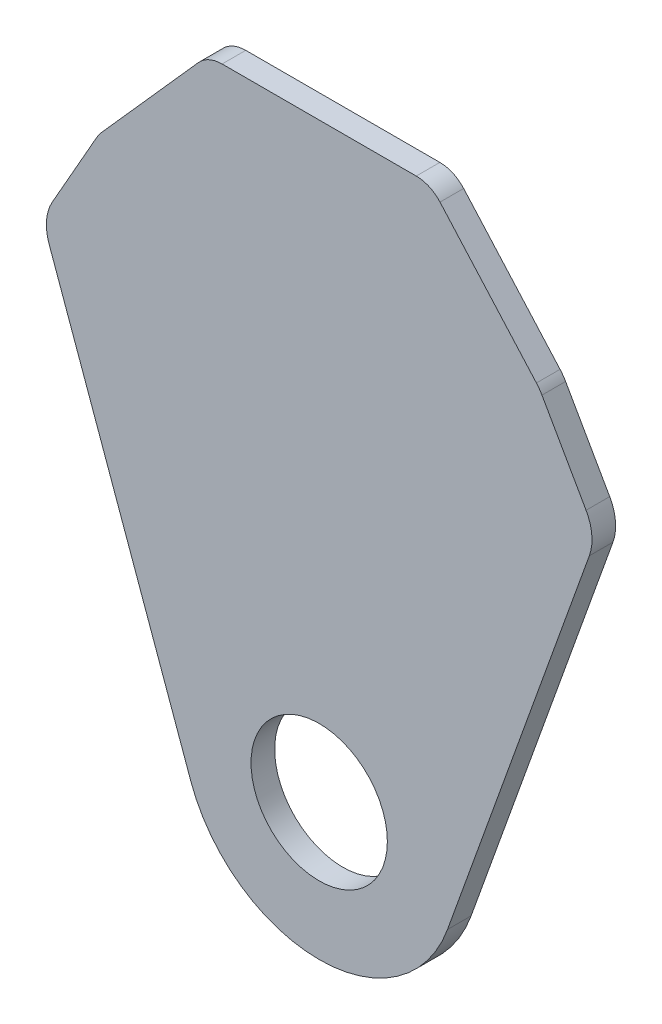
ISO-10303-21;
HEADER;
FILE_DESCRIPTION(('STEP AP214'),'2;1');
FILE_NAME('part.step','',(''),(''),'','','');
FILE_SCHEMA(('AUTOMOTIVE_DESIGN { 1 0 10303 214 1 1 1 1 }'));
ENDSEC;
DATA;
#1=APPLICATION_CONTEXT('core data for automotive mechanical design processes');
#2=APPLICATION_PROTOCOL_DEFINITION('international standard','automotive_design',2000,#1);
#3=PRODUCT_CONTEXT('',#1,'mechanical');
#4=PRODUCT('Part','Part','',(#3));
#5=PRODUCT_RELATED_PRODUCT_CATEGORY('part','',(#4));
#6=PRODUCT_DEFINITION_FORMATION('','',#4);
#7=PRODUCT_DEFINITION_CONTEXT('part definition',#1,'design');
#8=PRODUCT_DEFINITION('design','',#6,#7);
#9=PRODUCT_DEFINITION_SHAPE('','',#8);
#10=(LENGTH_UNIT() NAMED_UNIT(*) SI_UNIT(.MILLI.,.METRE.));
#11=(NAMED_UNIT(*) PLANE_ANGLE_UNIT() SI_UNIT($,.RADIAN.));
#12=(NAMED_UNIT(*) SI_UNIT($,.STERADIAN.) SOLID_ANGLE_UNIT());
#13=UNCERTAINTY_MEASURE_WITH_UNIT(LENGTH_MEASURE(1.E-05),#10,'distance_accuracy_value','');
#14=(GEOMETRIC_REPRESENTATION_CONTEXT(3) GLOBAL_UNCERTAINTY_ASSIGNED_CONTEXT((#13)) GLOBAL_UNIT_ASSIGNED_CONTEXT((#10,
#11,#12)) REPRESENTATION_CONTEXT('',''));
#15=CARTESIAN_POINT('',(0.,0.,0.));
#16=DIRECTION('',(0.,0.,1.));
#17=DIRECTION('',(1.,0.,0.));
#18=AXIS2_PLACEMENT_3D('',#15,#16,#17);
#19=CARTESIAN_POINT('',(0.,0.,6.604));
#20=DIRECTION('',(0.,0.,1.));
#21=DIRECTION('',(1.,0.,0.));
#22=AXIS2_PLACEMENT_3D('',#19,#20,#21);
#23=PLANE('',#22);
#24=DIRECTION('',(-1.,0.,0.));
#25=VECTOR('',#24,1.);
#26=CARTESIAN_POINT('',(-31.115,165.1,6.604));
#27=LINE('',#26,#25);
#28=CARTESIAN_POINT('',(27.1228026882818,165.1,6.604));
#29=VERTEX_POINT('',#28);
#30=CARTESIAN_POINT('',(-27.1228026882818,165.1,6.604));
#31=VERTEX_POINT('',#30);
#32=EDGE_CURVE('E174',#29,#31,#27,.T.);
#33=ORIENTED_EDGE('',*,*,#32,.T.);
#34=CARTESIAN_POINT('',(-27.1228026882818,156.21,6.604));
#35=DIRECTION('',(0.,0.,1.));
#36=DIRECTION('',(1.,0.,0.));
#37=AXIS2_PLACEMENT_3D('',#34,#35,#36);
#38=CIRCLE('',#37,8.89);
#39=CARTESIAN_POINT('',(-33.7672715313796,162.116194527198,6.604));
#40=VERTEX_POINT('',#39);
#41=EDGE_CURVE('E42',#31,#40,#38,.T.);
#42=ORIENTED_EDGE('',*,*,#41,.T.);
#43=DIRECTION('',(-0.66436383882992,-0.74740931868366,0.));
#44=VECTOR('',#43,1.);
#45=CARTESIAN_POINT('',(-61.595,130.81,6.604));
#46=LINE('',#45,#44);
#47=CARTESIAN_POINT('',(-60.7060258218473,131.810095950422,6.604));
#48=VERTEX_POINT('',#47);
#49=EDGE_CURVE('E195',#40,#48,#46,.T.);
#50=ORIENTED_EDGE('',*,*,#49,.T.);
#51=CARTESIAN_POINT('',(-51.2139274745648,123.372675197282,6.604));
#52=DIRECTION('',(0.,0.,1.));
#53=DIRECTION('',(1.,0.,0.));
#54=AXIS2_PLACEMENT_3D('',#51,#52,#53);
#55=CIRCLE('',#54,12.7);
#56=CARTESIAN_POINT('',(-62.2560257534529,129.646594673923,6.604));
#57=VERTEX_POINT('',#56);
#58=EDGE_CURVE('E216',#48,#57,#55,.T.);
#59=ORIENTED_EDGE('',*,*,#58,.T.);
#60=DIRECTION('',(-0.494009407609527,-0.869456557392768,0.));
#61=VECTOR('',#60,1.);
#62=CARTESIAN_POINT('',(-77.47,102.87,6.604));
#63=LINE('',#62,#61);
#64=CARTESIAN_POINT('',(-74.5857521885567,107.94627614814,6.604));
#65=VERTEX_POINT('',#64);
#66=EDGE_CURVE('E149',#57,#65,#63,.T.);
#67=ORIENTED_EDGE('',*,*,#66,.T.);
#68=CARTESIAN_POINT('',(-63.5436539096686,101.672356671499,6.604));
#69=DIRECTION('',(0.,0.,1.));
#70=DIRECTION('',(1.,0.,0.));
#71=AXIS2_PLACEMENT_3D('',#68,#69,#70);
#72=CIRCLE('',#71,12.7);
#73=CARTESIAN_POINT('',(-75.4947945005195,97.3758186956732,6.604));
#74=VERTEX_POINT('',#73);
#75=EDGE_CURVE('E145',#65,#74,#72,.T.);
#76=ORIENTED_EDGE('',*,*,#75,.T.);
#77=DIRECTION('',(0.338310076836694,-0.941034692192987,0.));
#78=VECTOR('',#77,1.);
#79=CARTESIAN_POINT('',(-77.47,102.87,6.604));
#80=LINE('',#79,#78);
#81=CARTESIAN_POINT('',(-35.8534217725528,-12.889613927478,6.604));
#82=VERTEX_POINT('',#81);
#83=EDGE_CURVE('E136',#74,#82,#80,.T.);
#84=ORIENTED_EDGE('',*,*,#83,.T.);
#85=CARTESIAN_POINT('',(0.,0.,6.604));
#86=DIRECTION('',(0.,0.,1.));
#87=DIRECTION('',(1.,0.,0.));
#88=AXIS2_PLACEMENT_3D('',#85,#86,#87);
#89=CIRCLE('',#88,38.1);
#90=CARTESIAN_POINT('',(35.8534217725528,-12.889613927478,6.604));
#91=VERTEX_POINT('',#90);
#92=EDGE_CURVE('E141',#82,#91,#89,.T.);
#93=ORIENTED_EDGE('',*,*,#92,.T.);
#94=DIRECTION('',(0.338310076836694,0.941034692192987,0.));
#95=VECTOR('',#94,1.);
#96=CARTESIAN_POINT('',(77.47,102.87,6.604));
#97=LINE('',#96,#95);
#98=CARTESIAN_POINT('',(75.4947945005195,97.3758186956732,6.604));
#99=VERTEX_POINT('',#98);
#100=EDGE_CURVE('E164',#91,#99,#97,.T.);
#101=ORIENTED_EDGE('',*,*,#100,.T.);
#102=CARTESIAN_POINT('',(63.5436539096686,101.672356671499,6.604));
#103=DIRECTION('',(0.,0.,1.));
#104=DIRECTION('',(1.,0.,0.));
#105=AXIS2_PLACEMENT_3D('',#102,#103,#104);
#106=CIRCLE('',#105,12.7);
#107=CARTESIAN_POINT('',(74.5857521885567,107.94627614814,6.604));
#108=VERTEX_POINT('',#107);
#109=EDGE_CURVE('E212',#99,#108,#106,.T.);
#110=ORIENTED_EDGE('',*,*,#109,.T.);
#111=DIRECTION('',(-0.494009407609527,0.869456557392768,0.));
#112=VECTOR('',#111,1.);
#113=CARTESIAN_POINT('',(77.47,102.87,6.604));
#114=LINE('',#113,#112);
#115=CARTESIAN_POINT('',(62.2560257534529,129.646594673923,6.604));
#116=VERTEX_POINT('',#115);
#117=EDGE_CURVE('E166',#108,#116,#114,.T.);
#118=ORIENTED_EDGE('',*,*,#117,.T.);
#119=CARTESIAN_POINT('',(51.2139274745648,123.372675197282,6.604));
#120=DIRECTION('',(0.,0.,1.));
#121=DIRECTION('',(1.,0.,0.));
#122=AXIS2_PLACEMENT_3D('',#119,#120,#121);
#123=CIRCLE('',#122,12.7);
#124=CARTESIAN_POINT('',(60.7060258218473,131.810095950422,6.604));
#125=VERTEX_POINT('',#124);
#126=EDGE_CURVE('E214',#116,#125,#123,.T.);
#127=ORIENTED_EDGE('',*,*,#126,.T.);
#128=DIRECTION('',(-0.66436383882992,0.74740931868366,0.));
#129=VECTOR('',#128,1.);
#130=CARTESIAN_POINT('',(31.115,165.1,6.604));
#131=LINE('',#130,#129);
#132=CARTESIAN_POINT('',(33.7672715313796,162.116194527198,6.604));
#133=VERTEX_POINT('',#132);
#134=EDGE_CURVE('E172',#125,#133,#131,.T.);
#135=ORIENTED_EDGE('',*,*,#134,.T.);
#136=CARTESIAN_POINT('',(27.1228026882818,156.21,6.604));
#137=DIRECTION('',(0.,0.,1.));
#138=DIRECTION('',(1.,0.,0.));
#139=AXIS2_PLACEMENT_3D('',#136,#137,#138);
#140=CIRCLE('',#139,8.89);
#141=EDGE_CURVE('E243',#133,#29,#140,.T.);
#142=ORIENTED_EDGE('',*,*,#141,.T.);
#143=EDGE_LOOP('',(#33,#42,#50,#59,#67,#76,#84,#93,#101,#110,#118,#127,#135,#142));
#144=FACE_BOUND('',#143,.T.);
#145=CARTESIAN_POINT('',(0.,0.,6.604));
#146=DIRECTION('',(0.,0.,1.));
#147=DIRECTION('',(1.,0.,0.));
#148=AXIS2_PLACEMENT_3D('',#145,#146,#147);
#149=CIRCLE('',#148,19.05);
#150=CARTESIAN_POINT('',(19.05,0.,6.604));
#151=VERTEX_POINT('',#150);
#152=EDGE_CURVE('E179',#151,#151,#149,.T.);
#153=ORIENTED_EDGE('',*,*,#152,.F.);
#154=EDGE_LOOP('',(#153));
#155=FACE_BOUND('',#154,.T.);
#156=ADVANCED_FACE('F34',(#144,#155),#23,.T.);
#157=CARTESIAN_POINT('',(0.,0.,0.));
#158=DIRECTION('',(0.,0.,1.));
#159=DIRECTION('',(1.,0.,0.));
#160=AXIS2_PLACEMENT_3D('',#157,#158,#159);
#161=PLANE('',#160);
#162=DIRECTION('',(-0.66436383882992,-0.74740931868366,0.));
#163=VECTOR('',#162,1.);
#164=CARTESIAN_POINT('',(-61.595,130.81,0.));
#165=LINE('',#164,#163);
#166=CARTESIAN_POINT('',(-33.7672715313796,162.116194527198,0.));
#167=VERTEX_POINT('',#166);
#168=CARTESIAN_POINT('',(-60.7060258218473,131.810095950422,0.));
#169=VERTEX_POINT('',#168);
#170=EDGE_CURVE('E176',#167,#169,#165,.T.);
#171=ORIENTED_EDGE('',*,*,#170,.F.);
#172=CARTESIAN_POINT('',(-27.1228026882818,156.21,0.));
#173=DIRECTION('',(0.,0.,1.));
#174=DIRECTION('',(1.,0.,0.));
#175=AXIS2_PLACEMENT_3D('',#172,#173,#174);
#176=CIRCLE('',#175,8.89);
#177=CARTESIAN_POINT('',(-27.1228026882818,165.1,0.));
#178=VERTEX_POINT('',#177);
#179=EDGE_CURVE('E237',#167,#178,#176,.F.);
#180=ORIENTED_EDGE('',*,*,#179,.T.);
#181=DIRECTION('',(-1.,0.,0.));
#182=VECTOR('',#181,1.);
#183=CARTESIAN_POINT('',(-31.115,165.1,0.));
#184=LINE('',#183,#182);
#185=CARTESIAN_POINT('',(27.1228026882818,165.1,0.));
#186=VERTEX_POINT('',#185);
#187=EDGE_CURVE('E193',#186,#178,#184,.T.);
#188=ORIENTED_EDGE('',*,*,#187,.F.);
#189=CARTESIAN_POINT('',(27.1228026882818,156.21,0.));
#190=DIRECTION('',(0.,0.,1.));
#191=DIRECTION('',(1.,0.,0.));
#192=AXIS2_PLACEMENT_3D('',#189,#190,#191);
#193=CIRCLE('',#192,8.89);
#194=CARTESIAN_POINT('',(33.7672715313796,162.116194527198,0.));
#195=VERTEX_POINT('',#194);
#196=EDGE_CURVE('E235',#186,#195,#193,.F.);
#197=ORIENTED_EDGE('',*,*,#196,.T.);
#198=DIRECTION('',(-0.66436383882992,0.74740931868366,0.));
#199=VECTOR('',#198,1.);
#200=CARTESIAN_POINT('',(31.115,165.1,0.));
#201=LINE('',#200,#199);
#202=CARTESIAN_POINT('',(60.7060258218473,131.810095950422,0.));
#203=VERTEX_POINT('',#202);
#204=EDGE_CURVE('E191',#203,#195,#201,.T.);
#205=ORIENTED_EDGE('',*,*,#204,.F.);
#206=CARTESIAN_POINT('',(51.2139274745648,123.372675197282,0.));
#207=DIRECTION('',(0.,0.,1.));
#208=DIRECTION('',(1.,0.,0.));
#209=AXIS2_PLACEMENT_3D('',#206,#207,#208);
#210=CIRCLE('',#209,12.7);
#211=CARTESIAN_POINT('',(62.2560257534529,129.646594673923,0.));
#212=VERTEX_POINT('',#211);
#213=EDGE_CURVE('E200',#203,#212,#210,.F.);
#214=ORIENTED_EDGE('',*,*,#213,.T.);
#215=DIRECTION('',(-0.494009407609527,0.869456557392768,0.));
#216=VECTOR('',#215,1.);
#217=CARTESIAN_POINT('',(77.47,102.87,0.));
#218=LINE('',#217,#216);
#219=CARTESIAN_POINT('',(74.5857521885567,107.94627614814,0.));
#220=VERTEX_POINT('',#219);
#221=EDGE_CURVE('E188',#220,#212,#218,.T.);
#222=ORIENTED_EDGE('',*,*,#221,.F.);
#223=CARTESIAN_POINT('',(63.5436539096686,101.672356671499,0.));
#224=DIRECTION('',(0.,0.,1.));
#225=DIRECTION('',(1.,0.,0.));
#226=AXIS2_PLACEMENT_3D('',#223,#224,#225);
#227=CIRCLE('',#226,12.7);
#228=CARTESIAN_POINT('',(75.4947945005195,97.3758186956732,0.));
#229=VERTEX_POINT('',#228);
#230=EDGE_CURVE('E198',#220,#229,#227,.F.);
#231=ORIENTED_EDGE('',*,*,#230,.T.);
#232=DIRECTION('',(0.338310076836694,0.941034692192987,0.));
#233=VECTOR('',#232,1.);
#234=CARTESIAN_POINT('',(77.47,102.87,0.));
#235=LINE('',#234,#233);
#236=CARTESIAN_POINT('',(35.8534217725528,-12.889613927478,0.));
#237=VERTEX_POINT('',#236);
#238=EDGE_CURVE('E185',#237,#229,#235,.T.);
#239=ORIENTED_EDGE('',*,*,#238,.F.);
#240=CARTESIAN_POINT('',(0.,0.,0.));
#241=DIRECTION('',(0.,0.,1.));
#242=DIRECTION('',(1.,0.,0.));
#243=AXIS2_PLACEMENT_3D('',#240,#241,#242);
#244=CIRCLE('',#243,38.1);
#245=CARTESIAN_POINT('',(-35.8534217725528,-12.889613927478,0.));
#246=VERTEX_POINT('',#245);
#247=EDGE_CURVE('E183',#246,#237,#244,.T.);
#248=ORIENTED_EDGE('',*,*,#247,.F.);
#249=DIRECTION('',(0.338310076836694,-0.941034692192987,0.));
#250=VECTOR('',#249,1.);
#251=CARTESIAN_POINT('',(-77.47,102.87,0.));
#252=LINE('',#251,#250);
#253=CARTESIAN_POINT('',(-75.4947945005195,97.3758186956732,0.));
#254=VERTEX_POINT('',#253);
#255=EDGE_CURVE('E155',#254,#246,#252,.T.);
#256=ORIENTED_EDGE('',*,*,#255,.F.);
#257=CARTESIAN_POINT('',(-63.5436539096686,101.672356671499,0.));
#258=DIRECTION('',(0.,0.,1.));
#259=DIRECTION('',(1.,0.,0.));
#260=AXIS2_PLACEMENT_3D('',#257,#258,#259);
#261=CIRCLE('',#260,12.7);
#262=CARTESIAN_POINT('',(-74.5857521885567,107.94627614814,0.));
#263=VERTEX_POINT('',#262);
#264=EDGE_CURVE('E205',#254,#263,#261,.F.);
#265=ORIENTED_EDGE('',*,*,#264,.T.);
#266=DIRECTION('',(-0.494009407609527,-0.869456557392768,0.));
#267=VECTOR('',#266,1.);
#268=CARTESIAN_POINT('',(-77.47,102.87,0.));
#269=LINE('',#268,#267);
#270=CARTESIAN_POINT('',(-62.2560257534529,129.646594673923,0.));
#271=VERTEX_POINT('',#270);
#272=EDGE_CURVE('E178',#271,#263,#269,.T.);
#273=ORIENTED_EDGE('',*,*,#272,.F.);
#274=CARTESIAN_POINT('',(-51.2139274745648,123.372675197282,0.));
#275=DIRECTION('',(0.,0.,1.));
#276=DIRECTION('',(1.,0.,0.));
#277=AXIS2_PLACEMENT_3D('',#274,#275,#276);
#278=CIRCLE('',#277,12.7);
#279=EDGE_CURVE('E202',#271,#169,#278,.F.);
#280=ORIENTED_EDGE('',*,*,#279,.T.);
#281=EDGE_LOOP('',(#171,#180,#188,#197,#205,#214,#222,#231,#239,#248,#256,#265,#273,#280));
#282=FACE_BOUND('',#281,.T.);
#283=CARTESIAN_POINT('',(0.,0.,0.));
#284=DIRECTION('',(0.,0.,1.));
#285=DIRECTION('',(1.,0.,0.));
#286=AXIS2_PLACEMENT_3D('',#283,#284,#285);
#287=CIRCLE('',#286,19.05);
#288=CARTESIAN_POINT('',(19.05,0.,0.));
#289=VERTEX_POINT('',#288);
#290=EDGE_CURVE('E429',#289,#289,#287,.T.);
#291=ORIENTED_EDGE('',*,*,#290,.T.);
#292=EDGE_LOOP('',(#291));
#293=FACE_BOUND('',#292,.T.);
#294=ADVANCED_FACE('F257',(#282,#293),#161,.F.);
#295=CARTESIAN_POINT('',(-61.595,130.81,6.604));
#296=DIRECTION('',(0.74740931868366,-0.664363838829919,0.));
#297=DIRECTION('',(0.66436383882992,0.74740931868366,0.));
#298=AXIS2_PLACEMENT_3D('',#295,#296,#297);
#299=PLANE('',#298);
#300=ORIENTED_EDGE('',*,*,#49,.F.);
#301=DIRECTION('',(0.,0.,-1.));
#302=VECTOR('',#301,1.);
#303=CARTESIAN_POINT('',(-33.7672715313796,162.116194527198,6.604));
#304=LINE('',#303,#302);
#305=EDGE_CURVE('E232',#40,#167,#304,.T.);
#306=ORIENTED_EDGE('',*,*,#305,.T.);
#307=ORIENTED_EDGE('',*,*,#170,.T.);
#308=DIRECTION('',(0.,0.,-1.));
#309=VECTOR('',#308,1.);
#310=CARTESIAN_POINT('',(-60.7060258218473,131.810095950422,6.604));
#311=LINE('',#310,#309);
#312=EDGE_CURVE('E219',#169,#48,#311,.F.);
#313=ORIENTED_EDGE('',*,*,#312,.T.);
#314=EDGE_LOOP('',(#300,#306,#307,#313));
#315=FACE_BOUND('',#314,.T.);
#316=ADVANCED_FACE('F249',(#315),#299,.F.);
#317=CARTESIAN_POINT('',(-77.47,102.87,6.604));
#318=DIRECTION('',(0.869456557392768,-0.494009407609527,0.));
#319=DIRECTION('',(0.494009407609527,0.869456557392768,0.));
#320=AXIS2_PLACEMENT_3D('',#317,#318,#319);
#321=PLANE('',#320);
#322=ORIENTED_EDGE('',*,*,#272,.T.);
#323=DIRECTION('',(0.,0.,-1.));
#324=VECTOR('',#323,1.);
#325=CARTESIAN_POINT('',(-74.5857521885567,107.94627614814,6.604));
#326=LINE('',#325,#324);
#327=EDGE_CURVE('E210',#263,#65,#326,.F.);
#328=ORIENTED_EDGE('',*,*,#327,.T.);
#329=ORIENTED_EDGE('',*,*,#66,.F.);
#330=DIRECTION('',(0.,0.,-1.));
#331=VECTOR('',#330,1.);
#332=CARTESIAN_POINT('',(-62.2560257534529,129.646594673923,6.604));
#333=LINE('',#332,#331);
#334=EDGE_CURVE('E207',#57,#271,#333,.T.);
#335=ORIENTED_EDGE('',*,*,#334,.T.);
#336=EDGE_LOOP('',(#322,#328,#329,#335));
#337=FACE_BOUND('',#336,.T.);
#338=ADVANCED_FACE('F395',(#337),#321,.F.);
#339=CARTESIAN_POINT('',(-77.47,102.87,6.604));
#340=DIRECTION('',(0.941034692192987,0.338310076836694,0.));
#341=DIRECTION('',(-0.338310076836694,0.941034692192987,0.));
#342=AXIS2_PLACEMENT_3D('',#339,#340,#341);
#343=PLANE('',#342);
#344=ORIENTED_EDGE('',*,*,#83,.F.);
#345=DIRECTION('',(0.,0.,-1.));
#346=VECTOR('',#345,1.);
#347=CARTESIAN_POINT('',(-75.4947945005195,97.3758186956732,6.604));
#348=LINE('',#347,#346);
#349=EDGE_CURVE('E158',#74,#254,#348,.T.);
#350=ORIENTED_EDGE('',*,*,#349,.T.);
#351=ORIENTED_EDGE('',*,*,#255,.T.);
#352=DIRECTION('',(0.,0.,-1.));
#353=VECTOR('',#352,1.);
#354=CARTESIAN_POINT('',(-35.8534217725528,-12.889613927478,6.604));
#355=LINE('',#354,#353);
#356=EDGE_CURVE('E152',#82,#246,#355,.T.);
#357=ORIENTED_EDGE('',*,*,#356,.F.);
#358=EDGE_LOOP('',(#344,#350,#351,#357));
#359=FACE_BOUND('',#358,.T.);
#360=ADVANCED_FACE('F153',(#359),#343,.F.);
#361=CARTESIAN_POINT('',(0.,0.,6.604));
#362=DIRECTION('',(0.,0.,-1.));
#363=DIRECTION('',(-1.,0.,0.));
#364=AXIS2_PLACEMENT_3D('',#361,#362,#363);
#365=CYLINDRICAL_SURFACE('',#364,38.1);
#366=ORIENTED_EDGE('',*,*,#247,.T.);
#367=DIRECTION('',(0.,0.,-1.));
#368=VECTOR('',#367,1.);
#369=CARTESIAN_POINT('',(35.8534217725528,-12.889613927478,6.604));
#370=LINE('',#369,#368);
#371=EDGE_CURVE('E159',#91,#237,#370,.T.);
#372=ORIENTED_EDGE('',*,*,#371,.F.);
#373=ORIENTED_EDGE('',*,*,#92,.F.);
#374=ORIENTED_EDGE('',*,*,#356,.T.);
#375=EDGE_LOOP('',(#366,#372,#373,#374));
#376=FACE_BOUND('',#375,.T.);
#377=ADVANCED_FACE('F161',(#376),#365,.T.);
#378=CARTESIAN_POINT('',(77.47,102.87,6.604));
#379=DIRECTION('',(-0.941034692192987,0.338310076836694,0.));
#380=DIRECTION('',(-0.338310076836694,-0.941034692192987,0.));
#381=AXIS2_PLACEMENT_3D('',#378,#379,#380);
#382=PLANE('',#381);
#383=ORIENTED_EDGE('',*,*,#238,.T.);
#384=DIRECTION('',(0.,0.,-1.));
#385=VECTOR('',#384,1.);
#386=CARTESIAN_POINT('',(75.4947945005195,97.3758186956732,6.604));
#387=LINE('',#386,#385);
#388=EDGE_CURVE('E230',#229,#99,#387,.F.);
#389=ORIENTED_EDGE('',*,*,#388,.T.);
#390=ORIENTED_EDGE('',*,*,#100,.F.);
#391=ORIENTED_EDGE('',*,*,#371,.T.);
#392=EDGE_LOOP('',(#383,#389,#390,#391));
#393=FACE_BOUND('',#392,.T.);
#394=ADVANCED_FACE('F281',(#393),#382,.F.);
#395=CARTESIAN_POINT('',(77.47,102.87,6.604));
#396=DIRECTION('',(-0.869456557392768,-0.494009407609527,0.));
#397=DIRECTION('',(0.494009407609527,-0.869456557392768,0.));
#398=AXIS2_PLACEMENT_3D('',#395,#396,#397);
#399=PLANE('',#398);
#400=ORIENTED_EDGE('',*,*,#221,.T.);
#401=DIRECTION('',(0.,0.,-1.));
#402=VECTOR('',#401,1.);
#403=CARTESIAN_POINT('',(62.2560257534529,129.646594673923,6.604));
#404=LINE('',#403,#402);
#405=EDGE_CURVE('E228',#212,#116,#404,.F.);
#406=ORIENTED_EDGE('',*,*,#405,.T.);
#407=ORIENTED_EDGE('',*,*,#117,.F.);
#408=DIRECTION('',(0.,0.,-1.));
#409=VECTOR('',#408,1.);
#410=CARTESIAN_POINT('',(74.5857521885567,107.94627614814,6.604));
#411=LINE('',#410,#409);
#412=EDGE_CURVE('E225',#108,#220,#411,.T.);
#413=ORIENTED_EDGE('',*,*,#412,.T.);
#414=EDGE_LOOP('',(#400,#406,#407,#413));
#415=FACE_BOUND('',#414,.T.);
#416=ADVANCED_FACE('F272',(#415),#399,.F.);
#417=CARTESIAN_POINT('',(31.115,165.1,6.604));
#418=DIRECTION('',(-0.74740931868366,-0.664363838829919,0.));
#419=DIRECTION('',(0.66436383882992,-0.74740931868366,0.));
#420=AXIS2_PLACEMENT_3D('',#417,#418,#419);
#421=PLANE('',#420);
#422=ORIENTED_EDGE('',*,*,#204,.T.);
#423=DIRECTION('',(0.,0.,-1.));
#424=VECTOR('',#423,1.);
#425=CARTESIAN_POINT('',(33.7672715313796,162.116194527198,6.604));
#426=LINE('',#425,#424);
#427=EDGE_CURVE('E11',#195,#133,#426,.F.);
#428=ORIENTED_EDGE('',*,*,#427,.T.);
#429=ORIENTED_EDGE('',*,*,#134,.F.);
#430=DIRECTION('',(0.,0.,-1.));
#431=VECTOR('',#430,1.);
#432=CARTESIAN_POINT('',(60.7060258218473,131.810095950422,6.604));
#433=LINE('',#432,#431);
#434=EDGE_CURVE('E222',#125,#203,#433,.T.);
#435=ORIENTED_EDGE('',*,*,#434,.T.);
#436=EDGE_LOOP('',(#422,#428,#429,#435));
#437=FACE_BOUND('',#436,.T.);
#438=ADVANCED_FACE('F264',(#437),#421,.F.);
#439=CARTESIAN_POINT('',(-31.115,165.1,6.604));
#440=DIRECTION('',(0.,-1.,0.));
#441=DIRECTION('',(0.,0.,-1.));
#442=AXIS2_PLACEMENT_3D('',#439,#440,#441);
#443=PLANE('',#442);
#444=ORIENTED_EDGE('',*,*,#187,.T.);
#445=DIRECTION('',(0.,0.,-1.));
#446=VECTOR('',#445,1.);
#447=CARTESIAN_POINT('',(-27.1228026882818,165.1,6.604));
#448=LINE('',#447,#446);
#449=EDGE_CURVE('E55',#178,#31,#448,.F.);
#450=ORIENTED_EDGE('',*,*,#449,.T.);
#451=ORIENTED_EDGE('',*,*,#32,.F.);
#452=DIRECTION('',(0.,0.,-1.));
#453=VECTOR('',#452,1.);
#454=CARTESIAN_POINT('',(27.1228026882818,165.1,6.604));
#455=LINE('',#454,#453);
#456=EDGE_CURVE('E239',#29,#186,#455,.T.);
#457=ORIENTED_EDGE('',*,*,#456,.T.);
#458=EDGE_LOOP('',(#444,#450,#451,#457));
#459=FACE_BOUND('',#458,.T.);
#460=ADVANCED_FACE('F259',(#459),#443,.F.);
#461=CARTESIAN_POINT('',(0.,0.,6.604));
#462=DIRECTION('',(0.,0.,-1.));
#463=DIRECTION('',(-1.,0.,0.));
#464=AXIS2_PLACEMENT_3D('',#461,#462,#463);
#465=CYLINDRICAL_SURFACE('',#464,19.05);
#466=ORIENTED_EDGE('',*,*,#152,.T.);
#467=EDGE_LOOP('',(#466));
#468=FACE_BOUND('',#467,.T.);
#469=ORIENTED_EDGE('',*,*,#290,.F.);
#470=EDGE_LOOP('',(#469));
#471=FACE_BOUND('',#470,.T.);
#472=ADVANCED_FACE('F297',(#468,#471),#465,.F.);
#473=CARTESIAN_POINT('',(-63.5436539096686,101.672356671499,6.604));
#474=DIRECTION('',(0.,0.,-1.));
#475=DIRECTION('',(-1.,0.,0.));
#476=AXIS2_PLACEMENT_3D('',#473,#474,#475);
#477=CYLINDRICAL_SURFACE('',#476,12.7);
#478=ORIENTED_EDGE('',*,*,#75,.F.);
#479=ORIENTED_EDGE('',*,*,#327,.F.);
#480=ORIENTED_EDGE('',*,*,#264,.F.);
#481=ORIENTED_EDGE('',*,*,#349,.F.);
#482=EDGE_LOOP('',(#478,#479,#480,#481));
#483=FACE_BOUND('',#482,.T.);
#484=ADVANCED_FACE('F318',(#483),#477,.T.);
#485=CARTESIAN_POINT('',(-51.2139274745648,123.372675197282,6.604));
#486=DIRECTION('',(0.,0.,-1.));
#487=DIRECTION('',(-1.,0.,0.));
#488=AXIS2_PLACEMENT_3D('',#485,#486,#487);
#489=CYLINDRICAL_SURFACE('',#488,12.7);
#490=ORIENTED_EDGE('',*,*,#58,.F.);
#491=ORIENTED_EDGE('',*,*,#312,.F.);
#492=ORIENTED_EDGE('',*,*,#279,.F.);
#493=ORIENTED_EDGE('',*,*,#334,.F.);
#494=EDGE_LOOP('',(#490,#491,#492,#493));
#495=FACE_BOUND('',#494,.T.);
#496=ADVANCED_FACE('F327',(#495),#489,.T.);
#497=CARTESIAN_POINT('',(51.2139274745648,123.372675197282,6.604));
#498=DIRECTION('',(0.,0.,-1.));
#499=DIRECTION('',(-1.,0.,0.));
#500=AXIS2_PLACEMENT_3D('',#497,#498,#499);
#501=CYLINDRICAL_SURFACE('',#500,12.7);
#502=ORIENTED_EDGE('',*,*,#126,.F.);
#503=ORIENTED_EDGE('',*,*,#405,.F.);
#504=ORIENTED_EDGE('',*,*,#213,.F.);
#505=ORIENTED_EDGE('',*,*,#434,.F.);
#506=EDGE_LOOP('',(#502,#503,#504,#505));
#507=FACE_BOUND('',#506,.T.);
#508=ADVANCED_FACE('F268',(#507),#501,.T.);
#509=CARTESIAN_POINT('',(63.5436539096686,101.672356671499,6.604));
#510=DIRECTION('',(0.,0.,-1.));
#511=DIRECTION('',(-1.,0.,0.));
#512=AXIS2_PLACEMENT_3D('',#509,#510,#511);
#513=CYLINDRICAL_SURFACE('',#512,12.7);
#514=ORIENTED_EDGE('',*,*,#109,.F.);
#515=ORIENTED_EDGE('',*,*,#388,.F.);
#516=ORIENTED_EDGE('',*,*,#230,.F.);
#517=ORIENTED_EDGE('',*,*,#412,.F.);
#518=EDGE_LOOP('',(#514,#515,#516,#517));
#519=FACE_BOUND('',#518,.T.);
#520=ADVANCED_FACE('F277',(#519),#513,.T.);
#521=CARTESIAN_POINT('',(-27.1228026882818,156.21,6.604));
#522=DIRECTION('',(0.,0.,-1.));
#523=DIRECTION('',(-1.,0.,0.));
#524=AXIS2_PLACEMENT_3D('',#521,#522,#523);
#525=CYLINDRICAL_SURFACE('',#524,8.89);
#526=ORIENTED_EDGE('',*,*,#41,.F.);
#527=ORIENTED_EDGE('',*,*,#449,.F.);
#528=ORIENTED_EDGE('',*,*,#179,.F.);
#529=ORIENTED_EDGE('',*,*,#305,.F.);
#530=EDGE_LOOP('',(#526,#527,#528,#529));
#531=FACE_BOUND('',#530,.T.);
#532=ADVANCED_FACE('F254',(#531),#525,.T.);
#533=CARTESIAN_POINT('',(27.1228026882818,156.21,6.604));
#534=DIRECTION('',(0.,0.,-1.));
#535=DIRECTION('',(-1.,0.,0.));
#536=AXIS2_PLACEMENT_3D('',#533,#534,#535);
#537=CYLINDRICAL_SURFACE('',#536,8.89);
#538=ORIENTED_EDGE('',*,*,#141,.F.);
#539=ORIENTED_EDGE('',*,*,#427,.F.);
#540=ORIENTED_EDGE('',*,*,#196,.F.);
#541=ORIENTED_EDGE('',*,*,#456,.F.);
#542=EDGE_LOOP('',(#538,#539,#540,#541));
#543=FACE_BOUND('',#542,.T.);
#544=ADVANCED_FACE('F36',(#543),#537,.T.);
#545=CLOSED_SHELL('',(#156,#294,#316,#338,#360,#377,#394,#416,#438,#460,#472,#484,#496,#508,
#520,#532,#544));
#546=MANIFOLD_SOLID_BREP('B2',#545);
#547=ADVANCED_BREP_SHAPE_REPRESENTATION('',(#18,#546),#14);
#548=SHAPE_DEFINITION_REPRESENTATION(#9,#547);
ENDSEC;
END-ISO-10303-21;
